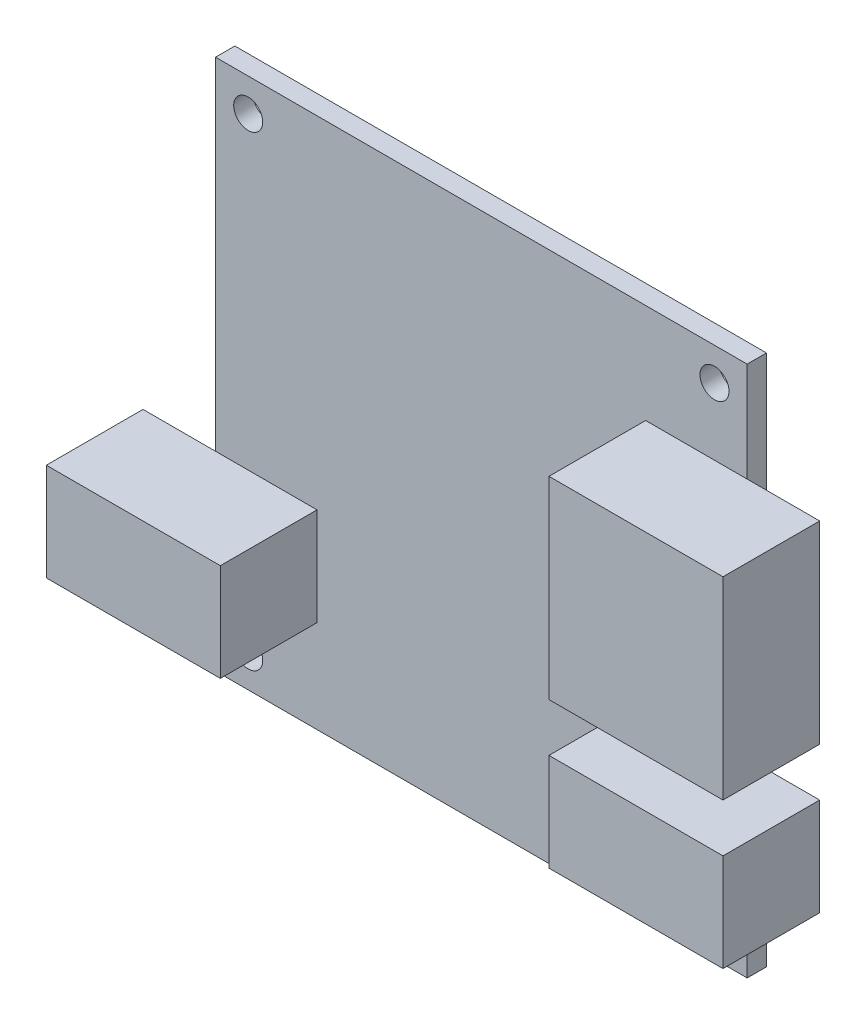
ISO-10303-21;
HEADER;
FILE_DESCRIPTION(('STEP AP214'),'2;1');
FILE_NAME('part.step','',(''),(''),'','','');
FILE_SCHEMA(('AUTOMOTIVE_DESIGN { 1 0 10303 214 1 1 1 1 }'));
ENDSEC;
DATA;
#1=APPLICATION_CONTEXT('core data for automotive mechanical design processes');
#2=APPLICATION_PROTOCOL_DEFINITION('international standard','automotive_design',2000,#1);
#3=PRODUCT_CONTEXT('',#1,'mechanical');
#4=PRODUCT('Part','Part','',(#3));
#5=PRODUCT_RELATED_PRODUCT_CATEGORY('part','',(#4));
#6=PRODUCT_DEFINITION_FORMATION('','',#4);
#7=PRODUCT_DEFINITION_CONTEXT('part definition',#1,'design');
#8=PRODUCT_DEFINITION('design','',#6,#7);
#9=PRODUCT_DEFINITION_SHAPE('','',#8);
#10=(LENGTH_UNIT() NAMED_UNIT(*) SI_UNIT(.MILLI.,.METRE.));
#11=(NAMED_UNIT(*) PLANE_ANGLE_UNIT() SI_UNIT($,.RADIAN.));
#12=(NAMED_UNIT(*) SI_UNIT($,.STERADIAN.) SOLID_ANGLE_UNIT());
#13=UNCERTAINTY_MEASURE_WITH_UNIT(LENGTH_MEASURE(1.E-05),#10,'distance_accuracy_value','');
#14=(GEOMETRIC_REPRESENTATION_CONTEXT(3) GLOBAL_UNCERTAINTY_ASSIGNED_CONTEXT((#13)) GLOBAL_UNIT_ASSIGNED_CONTEXT((#10,
#11,#12)) REPRESENTATION_CONTEXT('',''));
#15=CARTESIAN_POINT('',(0.,0.,0.));
#16=DIRECTION('',(0.,0.,1.));
#17=DIRECTION('',(1.,0.,0.));
#18=AXIS2_PLACEMENT_3D('',#15,#16,#17);
#19=CARTESIAN_POINT('',(0.,0.,2.));
#20=DIRECTION('',(0.,0.,-1.));
#21=DIRECTION('',(-1.,0.,0.));
#22=AXIS2_PLACEMENT_3D('',#19,#20,#21);
#23=PLANE('',#22);
#24=CARTESIAN_POINT('',(24.115,-24.115,2.));
#25=DIRECTION('',(0.,0.,-1.));
#26=DIRECTION('',(-1.,0.,0.));
#27=AXIS2_PLACEMENT_3D('',#24,#25,#26);
#28=CIRCLE('',#27,1.5);
#29=CARTESIAN_POINT('',(22.615,-24.115,2.));
#30=VERTEX_POINT('',#29);
#31=EDGE_CURVE('E274',#30,#30,#28,.T.);
#32=ORIENTED_EDGE('',*,*,#31,.T.);
#33=EDGE_LOOP('',(#32));
#34=FACE_BOUND('',#33,.T.);
#35=CARTESIAN_POINT('',(24.115,24.115,2.));
#36=DIRECTION('',(0.,0.,1.));
#37=DIRECTION('',(-1.,0.,0.));
#38=AXIS2_PLACEMENT_3D('',#35,#36,#37);
#39=CIRCLE('',#38,1.5);
#40=CARTESIAN_POINT('',(22.615,24.115,2.));
#41=VERTEX_POINT('',#40);
#42=EDGE_CURVE('E278',#41,#41,#39,.T.);
#43=ORIENTED_EDGE('',*,*,#42,.F.);
#44=EDGE_LOOP('',(#43));
#45=FACE_BOUND('',#44,.T.);
#46=CARTESIAN_POINT('',(-24.115,24.115,2.));
#47=DIRECTION('',(0.,0.,-1.));
#48=DIRECTION('',(1.,0.,0.));
#49=AXIS2_PLACEMENT_3D('',#46,#47,#48);
#50=CIRCLE('',#49,1.5);
#51=CARTESIAN_POINT('',(-22.615,24.115,2.));
#52=VERTEX_POINT('',#51);
#53=EDGE_CURVE('E284',#52,#52,#50,.T.);
#54=ORIENTED_EDGE('',*,*,#53,.T.);
#55=EDGE_LOOP('',(#54));
#56=FACE_BOUND('',#55,.T.);
#57=CARTESIAN_POINT('',(-24.115,-24.115,2.));
#58=DIRECTION('',(0.,0.,1.));
#59=DIRECTION('',(1.,0.,0.));
#60=AXIS2_PLACEMENT_3D('',#57,#58,#59);
#61=CIRCLE('',#60,1.5);
#62=CARTESIAN_POINT('',(-22.615,-24.115,2.));
#63=VERTEX_POINT('',#62);
#64=EDGE_CURVE('E290',#63,#63,#61,.T.);
#65=ORIENTED_EDGE('',*,*,#64,.F.);
#66=EDGE_LOOP('',(#65));
#67=FACE_BOUND('',#66,.T.);
#68=DIRECTION('',(0.,-1.,0.));
#69=VECTOR('',#68,1.);
#70=CARTESIAN_POINT('',(-27.495,-27.495,2.));
#71=LINE('',#70,#69);
#72=CARTESIAN_POINT('',(-27.495,27.495,2.));
#73=VERTEX_POINT('',#72);
#74=CARTESIAN_POINT('',(-27.495,-7.80499999999999,2.));
#75=VERTEX_POINT('',#74);
#76=EDGE_CURVE('E308',#73,#75,#71,.T.);
#77=ORIENTED_EDGE('',*,*,#76,.T.);
#78=DIRECTION('',(1.,0.,0.));
#79=VECTOR('',#78,1.);
#80=CARTESIAN_POINT('',(-16.995,-7.80499999999999,2.));
#81=LINE('',#80,#79);
#82=CARTESIAN_POINT('',(-16.995,-7.80499999999999,2.));
#83=VERTEX_POINT('',#82);
#84=EDGE_CURVE('E52',#75,#83,#81,.T.);
#85=ORIENTED_EDGE('',*,*,#84,.T.);
#86=DIRECTION('',(0.,-1.,0.));
#87=VECTOR('',#86,1.);
#88=CARTESIAN_POINT('',(-16.995,-7.80499999999999,2.));
#89=LINE('',#88,#87);
#90=CARTESIAN_POINT('',(-16.995,-17.905,2.));
#91=VERTEX_POINT('',#90);
#92=EDGE_CURVE('E57',#83,#91,#89,.T.);
#93=ORIENTED_EDGE('',*,*,#92,.T.);
#94=DIRECTION('',(-1.,0.,0.));
#95=VECTOR('',#94,1.);
#96=CARTESIAN_POINT('',(-16.995,-17.905,2.));
#97=LINE('',#96,#95);
#98=CARTESIAN_POINT('',(-27.495,-17.905,2.));
#99=VERTEX_POINT('',#98);
#100=EDGE_CURVE('E186',#91,#99,#97,.T.);
#101=ORIENTED_EDGE('',*,*,#100,.T.);
#102=CARTESIAN_POINT('',(-27.495,-27.495,2.));
#103=VERTEX_POINT('',#102);
#104=EDGE_CURVE('E307',#99,#103,#71,.T.);
#105=ORIENTED_EDGE('',*,*,#104,.T.);
#106=DIRECTION('',(1.,0.,0.));
#107=VECTOR('',#106,1.);
#108=CARTESIAN_POINT('',(-27.495,-27.495,2.));
#109=LINE('',#108,#107);
#110=CARTESIAN_POINT('',(27.495,-27.495,2.));
#111=VERTEX_POINT('',#110);
#112=EDGE_CURVE('E310',#103,#111,#109,.T.);
#113=ORIENTED_EDGE('',*,*,#112,.T.);
#114=DIRECTION('',(0.,1.,0.));
#115=VECTOR('',#114,1.);
#116=CARTESIAN_POINT('',(27.495,-27.495,2.));
#117=LINE('',#116,#115);
#118=CARTESIAN_POINT('',(27.495,-17.905,2.));
#119=VERTEX_POINT('',#118);
#120=EDGE_CURVE('E299',#111,#119,#117,.T.);
#121=ORIENTED_EDGE('',*,*,#120,.T.);
#122=DIRECTION('',(1.,0.,0.));
#123=VECTOR('',#122,1.);
#124=CARTESIAN_POINT('',(16.995,-17.905,2.));
#125=LINE('',#124,#123);
#126=CARTESIAN_POINT('',(16.995,-17.905,2.));
#127=VERTEX_POINT('',#126);
#128=EDGE_CURVE('E224',#127,#119,#125,.T.);
#129=ORIENTED_EDGE('',*,*,#128,.F.);
#130=DIRECTION('',(0.,-1.,0.));
#131=VECTOR('',#130,1.);
#132=CARTESIAN_POINT('',(16.995,-7.80499999999999,2.));
#133=LINE('',#132,#131);
#134=CARTESIAN_POINT('',(16.995,-7.80499999999999,2.));
#135=VERTEX_POINT('',#134);
#136=EDGE_CURVE('E175',#135,#127,#133,.T.);
#137=ORIENTED_EDGE('',*,*,#136,.F.);
#138=DIRECTION('',(-1.,0.,0.));
#139=VECTOR('',#138,1.);
#140=CARTESIAN_POINT('',(16.995,-7.80499999999999,2.));
#141=LINE('',#140,#139);
#142=CARTESIAN_POINT('',(27.495,-7.80499999999998,2.));
#143=VERTEX_POINT('',#142);
#144=EDGE_CURVE('E229',#143,#135,#141,.T.);
#145=ORIENTED_EDGE('',*,*,#144,.F.);
#146=CARTESIAN_POINT('',(27.495,-2.80499999999998,2.));
#147=VERTEX_POINT('',#146);
#148=EDGE_CURVE('E304',#143,#147,#117,.T.);
#149=ORIENTED_EDGE('',*,*,#148,.T.);
#150=DIRECTION('',(1.,0.,0.));
#151=VECTOR('',#150,1.);
#152=CARTESIAN_POINT('',(16.995,-2.80499999999998,2.));
#153=LINE('',#152,#151);
#154=CARTESIAN_POINT('',(16.995,-2.80499999999998,2.));
#155=VERTEX_POINT('',#154);
#156=EDGE_CURVE('E257',#155,#147,#153,.T.);
#157=ORIENTED_EDGE('',*,*,#156,.F.);
#158=DIRECTION('',(0.,-1.,0.));
#159=VECTOR('',#158,1.);
#160=CARTESIAN_POINT('',(16.995,17.195,2.));
#161=LINE('',#160,#159);
#162=CARTESIAN_POINT('',(16.995,17.195,2.));
#163=VERTEX_POINT('',#162);
#164=EDGE_CURVE('E243',#163,#155,#161,.T.);
#165=ORIENTED_EDGE('',*,*,#164,.F.);
#166=DIRECTION('',(-1.,0.,0.));
#167=VECTOR('',#166,1.);
#168=CARTESIAN_POINT('',(16.995,17.195,2.));
#169=LINE('',#168,#167);
#170=CARTESIAN_POINT('',(27.495,17.195,2.));
#171=VERTEX_POINT('',#170);
#172=EDGE_CURVE('E11',#171,#163,#169,.T.);
#173=ORIENTED_EDGE('',*,*,#172,.F.);
#174=CARTESIAN_POINT('',(27.495,27.495,2.));
#175=VERTEX_POINT('',#174);
#176=EDGE_CURVE('E322',#171,#175,#117,.T.);
#177=ORIENTED_EDGE('',*,*,#176,.T.);
#178=DIRECTION('',(-1.,0.,0.));
#179=VECTOR('',#178,1.);
#180=CARTESIAN_POINT('',(-27.495,27.495,2.));
#181=LINE('',#180,#179);
#182=EDGE_CURVE('E302',#175,#73,#181,.T.);
#183=ORIENTED_EDGE('',*,*,#182,.T.);
#184=EDGE_LOOP('',(#77,#85,#93,#101,#105,#113,#121,#129,#137,#145,#149,#157,#165,#173,#177,#183));
#185=FACE_BOUND('',#184,.T.);
#186=ADVANCED_FACE('F35',(#34,#45,#56,#67,#185),#23,.F.);
#187=CARTESIAN_POINT('',(27.495,-27.495,2.));
#188=DIRECTION('',(-1.,0.,0.));
#189=DIRECTION('',(0.,0.,1.));
#190=AXIS2_PLACEMENT_3D('',#187,#188,#189);
#191=PLANE('',#190);
#192=DIRECTION('',(0.,1.,0.));
#193=VECTOR('',#192,1.);
#194=CARTESIAN_POINT('',(27.495,-27.495,0.));
#195=LINE('',#194,#193);
#196=CARTESIAN_POINT('',(27.495,-27.495,0.));
#197=VERTEX_POINT('',#196);
#198=CARTESIAN_POINT('',(27.495,27.495,0.));
#199=VERTEX_POINT('',#198);
#200=EDGE_CURVE('E296',#197,#199,#195,.T.);
#201=ORIENTED_EDGE('',*,*,#200,.T.);
#202=DIRECTION('',(0.,0.,-1.));
#203=VECTOR('',#202,1.);
#204=CARTESIAN_POINT('',(27.495,27.495,2.));
#205=LINE('',#204,#203);
#206=EDGE_CURVE('E39',#175,#199,#205,.T.);
#207=ORIENTED_EDGE('',*,*,#206,.F.);
#208=ORIENTED_EDGE('',*,*,#176,.F.);
#209=EDGE_CURVE('E305',#147,#171,#117,.T.);
#210=ORIENTED_EDGE('',*,*,#209,.F.);
#211=ORIENTED_EDGE('',*,*,#148,.F.);
#212=EDGE_CURVE('E303',#119,#143,#117,.T.);
#213=ORIENTED_EDGE('',*,*,#212,.F.);
#214=ORIENTED_EDGE('',*,*,#120,.F.);
#215=DIRECTION('',(0.,0.,-1.));
#216=VECTOR('',#215,1.);
#217=CARTESIAN_POINT('',(27.495,-27.495,2.));
#218=LINE('',#217,#216);
#219=EDGE_CURVE('E313',#111,#197,#218,.T.);
#220=ORIENTED_EDGE('',*,*,#219,.T.);
#221=EDGE_LOOP('',(#201,#207,#208,#210,#211,#213,#214,#220));
#222=FACE_BOUND('',#221,.T.);
#223=ADVANCED_FACE('F37',(#222),#191,.F.);
#224=CARTESIAN_POINT('',(-27.495,27.495,2.));
#225=DIRECTION('',(0.,-1.,0.));
#226=DIRECTION('',(0.,0.,-1.));
#227=AXIS2_PLACEMENT_3D('',#224,#225,#226);
#228=PLANE('',#227);
#229=DIRECTION('',(-1.,0.,0.));
#230=VECTOR('',#229,1.);
#231=CARTESIAN_POINT('',(-27.495,27.495,0.));
#232=LINE('',#231,#230);
#233=CARTESIAN_POINT('',(-27.495,27.495,0.));
#234=VERTEX_POINT('',#233);
#235=EDGE_CURVE('E316',#199,#234,#232,.T.);
#236=ORIENTED_EDGE('',*,*,#235,.T.);
#237=DIRECTION('',(0.,0.,-1.));
#238=VECTOR('',#237,1.);
#239=CARTESIAN_POINT('',(-27.495,27.495,2.));
#240=LINE('',#239,#238);
#241=EDGE_CURVE('E327',#73,#234,#240,.T.);
#242=ORIENTED_EDGE('',*,*,#241,.F.);
#243=ORIENTED_EDGE('',*,*,#182,.F.);
#244=ORIENTED_EDGE('',*,*,#206,.T.);
#245=EDGE_LOOP('',(#236,#242,#243,#244));
#246=FACE_BOUND('',#245,.T.);
#247=ADVANCED_FACE('F337',(#246),#228,.F.);
#248=CARTESIAN_POINT('',(-27.495,-27.495,2.));
#249=DIRECTION('',(1.,0.,0.));
#250=DIRECTION('',(0.,0.,-1.));
#251=AXIS2_PLACEMENT_3D('',#248,#249,#250);
#252=PLANE('',#251);
#253=DIRECTION('',(0.,-1.,0.));
#254=VECTOR('',#253,1.);
#255=CARTESIAN_POINT('',(-27.495,-27.495,0.));
#256=LINE('',#255,#254);
#257=CARTESIAN_POINT('',(-27.495,-27.495,0.));
#258=VERTEX_POINT('',#257);
#259=EDGE_CURVE('E318',#234,#258,#256,.T.);
#260=ORIENTED_EDGE('',*,*,#259,.T.);
#261=DIRECTION('',(0.,0.,-1.));
#262=VECTOR('',#261,1.);
#263=CARTESIAN_POINT('',(-27.495,-27.495,2.));
#264=LINE('',#263,#262);
#265=EDGE_CURVE('E325',#103,#258,#264,.T.);
#266=ORIENTED_EDGE('',*,*,#265,.F.);
#267=ORIENTED_EDGE('',*,*,#104,.F.);
#268=EDGE_CURVE('E311',#75,#99,#71,.T.);
#269=ORIENTED_EDGE('',*,*,#268,.F.);
#270=ORIENTED_EDGE('',*,*,#76,.F.);
#271=ORIENTED_EDGE('',*,*,#241,.T.);
#272=EDGE_LOOP('',(#260,#266,#267,#269,#270,#271));
#273=FACE_BOUND('',#272,.T.);
#274=ADVANCED_FACE('F347',(#273),#252,.F.);
#275=CARTESIAN_POINT('',(-27.495,-27.495,2.));
#276=DIRECTION('',(0.,1.,0.));
#277=DIRECTION('',(0.,0.,1.));
#278=AXIS2_PLACEMENT_3D('',#275,#276,#277);
#279=PLANE('',#278);
#280=DIRECTION('',(1.,0.,0.));
#281=VECTOR('',#280,1.);
#282=CARTESIAN_POINT('',(-27.495,-27.495,0.));
#283=LINE('',#282,#281);
#284=EDGE_CURVE('E320',#258,#197,#283,.T.);
#285=ORIENTED_EDGE('',*,*,#284,.T.);
#286=ORIENTED_EDGE('',*,*,#219,.F.);
#287=ORIENTED_EDGE('',*,*,#112,.F.);
#288=ORIENTED_EDGE('',*,*,#265,.T.);
#289=EDGE_LOOP('',(#285,#286,#287,#288));
#290=FACE_BOUND('',#289,.T.);
#291=ADVANCED_FACE('F350',(#290),#279,.F.);
#292=CARTESIAN_POINT('',(0.,0.,0.));
#293=DIRECTION('',(0.,0.,-1.));
#294=DIRECTION('',(-1.,0.,0.));
#295=AXIS2_PLACEMENT_3D('',#292,#293,#294);
#296=PLANE('',#295);
#297=CARTESIAN_POINT('',(24.115,-24.115,0.));
#298=DIRECTION('',(0.,0.,-1.));
#299=DIRECTION('',(-1.,0.,0.));
#300=AXIS2_PLACEMENT_3D('',#297,#298,#299);
#301=CIRCLE('',#300,1.5);
#302=CARTESIAN_POINT('',(22.615,-24.115,0.));
#303=VERTEX_POINT('',#302);
#304=EDGE_CURVE('E275',#303,#303,#301,.T.);
#305=ORIENTED_EDGE('',*,*,#304,.F.);
#306=EDGE_LOOP('',(#305));
#307=FACE_BOUND('',#306,.T.);
#308=CARTESIAN_POINT('',(24.115,24.115,0.));
#309=DIRECTION('',(0.,0.,1.));
#310=DIRECTION('',(-1.,0.,0.));
#311=AXIS2_PLACEMENT_3D('',#308,#309,#310);
#312=CIRCLE('',#311,1.5);
#313=CARTESIAN_POINT('',(22.615,24.115,0.));
#314=VERTEX_POINT('',#313);
#315=EDGE_CURVE('E281',#314,#314,#312,.T.);
#316=ORIENTED_EDGE('',*,*,#315,.T.);
#317=EDGE_LOOP('',(#316));
#318=FACE_BOUND('',#317,.T.);
#319=CARTESIAN_POINT('',(-24.115,24.115,0.));
#320=DIRECTION('',(0.,0.,-1.));
#321=DIRECTION('',(1.,0.,0.));
#322=AXIS2_PLACEMENT_3D('',#319,#320,#321);
#323=CIRCLE('',#322,1.5);
#324=CARTESIAN_POINT('',(-22.615,24.115,0.));
#325=VERTEX_POINT('',#324);
#326=EDGE_CURVE('E287',#325,#325,#323,.T.);
#327=ORIENTED_EDGE('',*,*,#326,.F.);
#328=EDGE_LOOP('',(#327));
#329=FACE_BOUND('',#328,.T.);
#330=CARTESIAN_POINT('',(-24.115,-24.115,0.));
#331=DIRECTION('',(0.,0.,1.));
#332=DIRECTION('',(1.,0.,0.));
#333=AXIS2_PLACEMENT_3D('',#330,#331,#332);
#334=CIRCLE('',#333,1.5);
#335=CARTESIAN_POINT('',(-22.615,-24.115,0.));
#336=VERTEX_POINT('',#335);
#337=EDGE_CURVE('E293',#336,#336,#334,.T.);
#338=ORIENTED_EDGE('',*,*,#337,.T.);
#339=EDGE_LOOP('',(#338));
#340=FACE_BOUND('',#339,.T.);
#341=ORIENTED_EDGE('',*,*,#200,.F.);
#342=ORIENTED_EDGE('',*,*,#284,.F.);
#343=ORIENTED_EDGE('',*,*,#259,.F.);
#344=ORIENTED_EDGE('',*,*,#235,.F.);
#345=EDGE_LOOP('',(#341,#342,#343,#344));
#346=FACE_BOUND('',#345,.T.);
#347=ADVANCED_FACE('F345',(#307,#318,#329,#340,#346),#296,.T.);
#348=CARTESIAN_POINT('',(-24.115,-24.115,0.));
#349=DIRECTION('',(0.,0.,1.));
#350=DIRECTION('',(1.,0.,0.));
#351=AXIS2_PLACEMENT_3D('',#348,#349,#350);
#352=CYLINDRICAL_SURFACE('',#351,1.5);
#353=ORIENTED_EDGE('',*,*,#337,.F.);
#354=EDGE_LOOP('',(#353));
#355=FACE_BOUND('',#354,.T.);
#356=ORIENTED_EDGE('',*,*,#64,.T.);
#357=EDGE_LOOP('',(#356));
#358=FACE_BOUND('',#357,.T.);
#359=ADVANCED_FACE('F379',(#355,#358),#352,.F.);
#360=CARTESIAN_POINT('',(-24.115,24.115,0.));
#361=DIRECTION('',(0.,0.,1.));
#362=DIRECTION('',(1.,0.,0.));
#363=AXIS2_PLACEMENT_3D('',#360,#361,#362);
#364=CYLINDRICAL_SURFACE('',#363,1.5);
#365=ORIENTED_EDGE('',*,*,#326,.T.);
#366=EDGE_LOOP('',(#365));
#367=FACE_BOUND('',#366,.T.);
#368=ORIENTED_EDGE('',*,*,#53,.F.);
#369=EDGE_LOOP('',(#368));
#370=FACE_BOUND('',#369,.T.);
#371=ADVANCED_FACE('F413',(#367,#370),#364,.F.);
#372=CARTESIAN_POINT('',(24.115,24.115,0.));
#373=DIRECTION('',(0.,0.,1.));
#374=DIRECTION('',(1.,0.,0.));
#375=AXIS2_PLACEMENT_3D('',#372,#373,#374);
#376=CYLINDRICAL_SURFACE('',#375,1.5);
#377=ORIENTED_EDGE('',*,*,#315,.F.);
#378=EDGE_LOOP('',(#377));
#379=FACE_BOUND('',#378,.T.);
#380=ORIENTED_EDGE('',*,*,#42,.T.);
#381=EDGE_LOOP('',(#380));
#382=FACE_BOUND('',#381,.T.);
#383=ADVANCED_FACE('F419',(#379,#382),#376,.F.);
#384=CARTESIAN_POINT('',(24.115,-24.115,0.));
#385=DIRECTION('',(0.,0.,1.));
#386=DIRECTION('',(1.,0.,0.));
#387=AXIS2_PLACEMENT_3D('',#384,#385,#386);
#388=CYLINDRICAL_SURFACE('',#387,1.5);
#389=ORIENTED_EDGE('',*,*,#304,.T.);
#390=EDGE_LOOP('',(#389));
#391=FACE_BOUND('',#390,.T.);
#392=ORIENTED_EDGE('',*,*,#31,.F.);
#393=EDGE_LOOP('',(#392));
#394=FACE_BOUND('',#393,.T.);
#395=ADVANCED_FACE('F425',(#391,#394),#388,.F.);
#396=CARTESIAN_POINT('',(0.,0.,2.));
#397=DIRECTION('',(0.,0.,1.));
#398=DIRECTION('',(1.,0.,0.));
#399=AXIS2_PLACEMENT_3D('',#396,#397,#398);
#400=PLANE('',#399);
#401=CARTESIAN_POINT('',(34.995,-2.80499999999998,2.));
#402=VERTEX_POINT('',#401);
#403=EDGE_CURVE('E256',#147,#402,#153,.T.);
#404=ORIENTED_EDGE('',*,*,#403,.F.);
#405=ORIENTED_EDGE('',*,*,#209,.T.);
#406=CARTESIAN_POINT('',(34.995,17.195,2.));
#407=VERTEX_POINT('',#406);
#408=EDGE_CURVE('E45',#407,#171,#169,.T.);
#409=ORIENTED_EDGE('',*,*,#408,.F.);
#410=DIRECTION('',(0.,1.,0.));
#411=VECTOR('',#410,1.);
#412=CARTESIAN_POINT('',(34.995,17.195,2.));
#413=LINE('',#412,#411);
#414=EDGE_CURVE('E260',#402,#407,#413,.T.);
#415=ORIENTED_EDGE('',*,*,#414,.F.);
#416=EDGE_LOOP('',(#404,#405,#409,#415));
#417=FACE_BOUND('',#416,.T.);
#418=ADVANCED_FACE('F433',(#417),#400,.F.);
#419=CARTESIAN_POINT('',(16.995,17.195,12.));
#420=DIRECTION('',(1.,0.,0.));
#421=DIRECTION('',(0.,1.,0.));
#422=AXIS2_PLACEMENT_3D('',#419,#420,#421);
#423=PLANE('',#422);
#424=ORIENTED_EDGE('',*,*,#164,.T.);
#425=DIRECTION('',(0.,0.,-1.));
#426=VECTOR('',#425,1.);
#427=CARTESIAN_POINT('',(16.995,-2.80499999999998,12.));
#428=LINE('',#427,#426);
#429=CARTESIAN_POINT('',(16.995,-2.80499999999998,12.));
#430=VERTEX_POINT('',#429);
#431=EDGE_CURVE('E271',#430,#155,#428,.T.);
#432=ORIENTED_EDGE('',*,*,#431,.F.);
#433=DIRECTION('',(0.,-1.,0.));
#434=VECTOR('',#433,1.);
#435=CARTESIAN_POINT('',(16.995,17.195,12.));
#436=LINE('',#435,#434);
#437=CARTESIAN_POINT('',(16.995,17.195,12.));
#438=VERTEX_POINT('',#437);
#439=EDGE_CURVE('E244',#438,#430,#436,.T.);
#440=ORIENTED_EDGE('',*,*,#439,.F.);
#441=DIRECTION('',(0.,0.,-1.));
#442=VECTOR('',#441,1.);
#443=CARTESIAN_POINT('',(16.995,17.195,12.));
#444=LINE('',#443,#442);
#445=EDGE_CURVE('E253',#438,#163,#444,.T.);
#446=ORIENTED_EDGE('',*,*,#445,.T.);
#447=EDGE_LOOP('',(#424,#432,#440,#446));
#448=FACE_BOUND('',#447,.T.);
#449=ADVANCED_FACE('F441',(#448),#423,.F.);
#450=CARTESIAN_POINT('',(16.995,-2.80499999999998,12.));
#451=DIRECTION('',(0.,1.,0.));
#452=DIRECTION('',(0.,0.,1.));
#453=AXIS2_PLACEMENT_3D('',#450,#451,#452);
#454=PLANE('',#453);
#455=ORIENTED_EDGE('',*,*,#156,.T.);
#456=ORIENTED_EDGE('',*,*,#403,.T.);
#457=DIRECTION('',(0.,0.,-1.));
#458=VECTOR('',#457,1.);
#459=CARTESIAN_POINT('',(34.995,-2.80499999999998,12.));
#460=LINE('',#459,#458);
#461=CARTESIAN_POINT('',(34.995,-2.80499999999998,12.));
#462=VERTEX_POINT('',#461);
#463=EDGE_CURVE('E268',#462,#402,#460,.T.);
#464=ORIENTED_EDGE('',*,*,#463,.F.);
#465=DIRECTION('',(1.,0.,0.));
#466=VECTOR('',#465,1.);
#467=CARTESIAN_POINT('',(16.995,-2.80499999999998,12.));
#468=LINE('',#467,#466);
#469=EDGE_CURVE('E247',#430,#462,#468,.T.);
#470=ORIENTED_EDGE('',*,*,#469,.F.);
#471=ORIENTED_EDGE('',*,*,#431,.T.);
#472=EDGE_LOOP('',(#455,#456,#464,#470,#471));
#473=FACE_BOUND('',#472,.T.);
#474=ADVANCED_FACE('F449',(#473),#454,.F.);
#475=CARTESIAN_POINT('',(34.995,17.195,12.));
#476=DIRECTION('',(-1.,0.,0.));
#477=DIRECTION('',(0.,0.,1.));
#478=AXIS2_PLACEMENT_3D('',#475,#476,#477);
#479=PLANE('',#478);
#480=ORIENTED_EDGE('',*,*,#414,.T.);
#481=DIRECTION('',(0.,0.,-1.));
#482=VECTOR('',#481,1.);
#483=CARTESIAN_POINT('',(34.995,17.195,12.));
#484=LINE('',#483,#482);
#485=CARTESIAN_POINT('',(34.995,17.195,12.));
#486=VERTEX_POINT('',#485);
#487=EDGE_CURVE('E265',#486,#407,#484,.T.);
#488=ORIENTED_EDGE('',*,*,#487,.F.);
#489=DIRECTION('',(0.,1.,0.));
#490=VECTOR('',#489,1.);
#491=CARTESIAN_POINT('',(34.995,17.195,12.));
#492=LINE('',#491,#490);
#493=EDGE_CURVE('E249',#462,#486,#492,.T.);
#494=ORIENTED_EDGE('',*,*,#493,.F.);
#495=ORIENTED_EDGE('',*,*,#463,.T.);
#496=EDGE_LOOP('',(#480,#488,#494,#495));
#497=FACE_BOUND('',#496,.T.);
#498=ADVANCED_FACE('F457',(#497),#479,.F.);
#499=CARTESIAN_POINT('',(16.995,17.195,12.));
#500=DIRECTION('',(0.,-1.,0.));
#501=DIRECTION('',(0.,0.,-1.));
#502=AXIS2_PLACEMENT_3D('',#499,#500,#501);
#503=PLANE('',#502);
#504=ORIENTED_EDGE('',*,*,#408,.T.);
#505=ORIENTED_EDGE('',*,*,#172,.T.);
#506=ORIENTED_EDGE('',*,*,#445,.F.);
#507=DIRECTION('',(-1.,0.,0.));
#508=VECTOR('',#507,1.);
#509=CARTESIAN_POINT('',(16.995,17.195,12.));
#510=LINE('',#509,#508);
#511=EDGE_CURVE('E251',#486,#438,#510,.T.);
#512=ORIENTED_EDGE('',*,*,#511,.F.);
#513=ORIENTED_EDGE('',*,*,#487,.T.);
#514=EDGE_LOOP('',(#504,#505,#506,#512,#513));
#515=FACE_BOUND('',#514,.T.);
#516=ADVANCED_FACE('F465',(#515),#503,.F.);
#517=CARTESIAN_POINT('',(0.,0.,12.));
#518=DIRECTION('',(0.,0.,1.));
#519=DIRECTION('',(1.,0.,0.));
#520=AXIS2_PLACEMENT_3D('',#517,#518,#519);
#521=PLANE('',#520);
#522=ORIENTED_EDGE('',*,*,#439,.T.);
#523=ORIENTED_EDGE('',*,*,#469,.T.);
#524=ORIENTED_EDGE('',*,*,#493,.T.);
#525=ORIENTED_EDGE('',*,*,#511,.T.);
#526=EDGE_LOOP('',(#522,#523,#524,#525));
#527=FACE_BOUND('',#526,.T.);
#528=ADVANCED_FACE('F473',(#527),#521,.T.);
#529=CARTESIAN_POINT('',(0.,0.,2.));
#530=DIRECTION('',(0.,0.,1.));
#531=DIRECTION('',(1.,0.,0.));
#532=AXIS2_PLACEMENT_3D('',#529,#530,#531);
#533=PLANE('',#532);
#534=CARTESIAN_POINT('',(34.995,-17.905,2.));
#535=VERTEX_POINT('',#534);
#536=EDGE_CURVE('E223',#119,#535,#125,.T.);
#537=ORIENTED_EDGE('',*,*,#536,.F.);
#538=ORIENTED_EDGE('',*,*,#212,.T.);
#539=CARTESIAN_POINT('',(34.995,-7.80499999999998,2.));
#540=VERTEX_POINT('',#539);
#541=EDGE_CURVE('E214',#540,#143,#141,.T.);
#542=ORIENTED_EDGE('',*,*,#541,.F.);
#543=DIRECTION('',(0.,1.,0.));
#544=VECTOR('',#543,1.);
#545=CARTESIAN_POINT('',(34.995,-7.80499999999998,2.));
#546=LINE('',#545,#544);
#547=EDGE_CURVE('E227',#535,#540,#546,.T.);
#548=ORIENTED_EDGE('',*,*,#547,.F.);
#549=EDGE_LOOP('',(#537,#538,#542,#548));
#550=FACE_BOUND('',#549,.T.);
#551=ADVANCED_FACE('F481',(#550),#533,.F.);
#552=CARTESIAN_POINT('',(16.995,-7.80499999999999,12.));
#553=DIRECTION('',(1.,0.,0.));
#554=DIRECTION('',(0.,0.,-1.));
#555=AXIS2_PLACEMENT_3D('',#552,#553,#554);
#556=PLANE('',#555);
#557=ORIENTED_EDGE('',*,*,#136,.T.);
#558=DIRECTION('',(0.,0.,-1.));
#559=VECTOR('',#558,1.);
#560=CARTESIAN_POINT('',(16.995,-17.905,12.));
#561=LINE('',#560,#559);
#562=CARTESIAN_POINT('',(16.995,-17.905,12.));
#563=VERTEX_POINT('',#562);
#564=EDGE_CURVE('E240',#563,#127,#561,.T.);
#565=ORIENTED_EDGE('',*,*,#564,.F.);
#566=DIRECTION('',(0.,-1.,0.));
#567=VECTOR('',#566,1.);
#568=CARTESIAN_POINT('',(16.995,-7.80499999999999,12.));
#569=LINE('',#568,#567);
#570=CARTESIAN_POINT('',(16.995,-7.80499999999999,12.));
#571=VERTEX_POINT('',#570);
#572=EDGE_CURVE('E210',#571,#563,#569,.T.);
#573=ORIENTED_EDGE('',*,*,#572,.F.);
#574=DIRECTION('',(0.,0.,-1.));
#575=VECTOR('',#574,1.);
#576=CARTESIAN_POINT('',(16.995,-7.80499999999999,12.));
#577=LINE('',#576,#575);
#578=EDGE_CURVE('E220',#571,#135,#577,.T.);
#579=ORIENTED_EDGE('',*,*,#578,.T.);
#580=EDGE_LOOP('',(#557,#565,#573,#579));
#581=FACE_BOUND('',#580,.T.);
#582=ADVANCED_FACE('F489',(#581),#556,.F.);
#583=CARTESIAN_POINT('',(16.995,-17.905,12.));
#584=DIRECTION('',(0.,1.,0.));
#585=DIRECTION('',(0.,0.,1.));
#586=AXIS2_PLACEMENT_3D('',#583,#584,#585);
#587=PLANE('',#586);
#588=ORIENTED_EDGE('',*,*,#128,.T.);
#589=ORIENTED_EDGE('',*,*,#536,.T.);
#590=DIRECTION('',(0.,0.,-1.));
#591=VECTOR('',#590,1.);
#592=CARTESIAN_POINT('',(34.995,-17.905,12.));
#593=LINE('',#592,#591);
#594=CARTESIAN_POINT('',(34.995,-17.905,12.));
#595=VERTEX_POINT('',#594);
#596=EDGE_CURVE('E237',#595,#535,#593,.T.);
#597=ORIENTED_EDGE('',*,*,#596,.F.);
#598=DIRECTION('',(1.,0.,0.));
#599=VECTOR('',#598,1.);
#600=CARTESIAN_POINT('',(16.995,-17.905,12.));
#601=LINE('',#600,#599);
#602=EDGE_CURVE('E213',#563,#595,#601,.T.);
#603=ORIENTED_EDGE('',*,*,#602,.F.);
#604=ORIENTED_EDGE('',*,*,#564,.T.);
#605=EDGE_LOOP('',(#588,#589,#597,#603,#604));
#606=FACE_BOUND('',#605,.T.);
#607=ADVANCED_FACE('F497',(#606),#587,.F.);
#608=CARTESIAN_POINT('',(34.995,-7.80499999999998,12.));
#609=DIRECTION('',(-1.,0.,0.));
#610=DIRECTION('',(0.,-1.,0.));
#611=AXIS2_PLACEMENT_3D('',#608,#609,#610);
#612=PLANE('',#611);
#613=ORIENTED_EDGE('',*,*,#547,.T.);
#614=DIRECTION('',(0.,0.,-1.));
#615=VECTOR('',#614,1.);
#616=CARTESIAN_POINT('',(34.995,-7.80499999999998,12.));
#617=LINE('',#616,#615);
#618=CARTESIAN_POINT('',(34.995,-7.80499999999998,12.));
#619=VERTEX_POINT('',#618);
#620=EDGE_CURVE('E234',#619,#540,#617,.T.);
#621=ORIENTED_EDGE('',*,*,#620,.F.);
#622=DIRECTION('',(0.,1.,0.));
#623=VECTOR('',#622,1.);
#624=CARTESIAN_POINT('',(34.995,-7.80499999999998,12.));
#625=LINE('',#624,#623);
#626=EDGE_CURVE('E216',#595,#619,#625,.T.);
#627=ORIENTED_EDGE('',*,*,#626,.F.);
#628=ORIENTED_EDGE('',*,*,#596,.T.);
#629=EDGE_LOOP('',(#613,#621,#627,#628));
#630=FACE_BOUND('',#629,.T.);
#631=ADVANCED_FACE('F505',(#630),#612,.F.);
#632=CARTESIAN_POINT('',(16.995,-7.80499999999999,12.));
#633=DIRECTION('',(0.,-1.,0.));
#634=DIRECTION('',(1.,0.,0.));
#635=AXIS2_PLACEMENT_3D('',#632,#633,#634);
#636=PLANE('',#635);
#637=ORIENTED_EDGE('',*,*,#541,.T.);
#638=ORIENTED_EDGE('',*,*,#144,.T.);
#639=ORIENTED_EDGE('',*,*,#578,.F.);
#640=DIRECTION('',(-1.,0.,0.));
#641=VECTOR('',#640,1.);
#642=CARTESIAN_POINT('',(16.995,-7.80499999999999,12.));
#643=LINE('',#642,#641);
#644=EDGE_CURVE('E218',#619,#571,#643,.T.);
#645=ORIENTED_EDGE('',*,*,#644,.F.);
#646=ORIENTED_EDGE('',*,*,#620,.T.);
#647=EDGE_LOOP('',(#637,#638,#639,#645,#646));
#648=FACE_BOUND('',#647,.T.);
#649=ADVANCED_FACE('F513',(#648),#636,.F.);
#650=CARTESIAN_POINT('',(0.,0.,12.));
#651=DIRECTION('',(0.,0.,1.));
#652=DIRECTION('',(1.,0.,0.));
#653=AXIS2_PLACEMENT_3D('',#650,#651,#652);
#654=PLANE('',#653);
#655=ORIENTED_EDGE('',*,*,#572,.T.);
#656=ORIENTED_EDGE('',*,*,#602,.T.);
#657=ORIENTED_EDGE('',*,*,#626,.T.);
#658=ORIENTED_EDGE('',*,*,#644,.T.);
#659=EDGE_LOOP('',(#655,#656,#657,#658));
#660=FACE_BOUND('',#659,.T.);
#661=ADVANCED_FACE('F521',(#660),#654,.T.);
#662=CARTESIAN_POINT('',(0.,0.,2.));
#663=DIRECTION('',(0.,0.,1.));
#664=DIRECTION('',(-1.,0.,0.));
#665=AXIS2_PLACEMENT_3D('',#662,#663,#664);
#666=PLANE('',#665);
#667=CARTESIAN_POINT('',(-34.995,-7.80499999999998,2.));
#668=VERTEX_POINT('',#667);
#669=EDGE_CURVE('E197',#668,#75,#81,.T.);
#670=ORIENTED_EDGE('',*,*,#669,.T.);
#671=ORIENTED_EDGE('',*,*,#268,.T.);
#672=CARTESIAN_POINT('',(-34.995,-17.905,2.));
#673=VERTEX_POINT('',#672);
#674=EDGE_CURVE('E203',#99,#673,#97,.T.);
#675=ORIENTED_EDGE('',*,*,#674,.T.);
#676=DIRECTION('',(0.,1.,0.));
#677=VECTOR('',#676,1.);
#678=CARTESIAN_POINT('',(-34.995,-7.80499999999998,2.));
#679=LINE('',#678,#677);
#680=EDGE_CURVE('E200',#673,#668,#679,.T.);
#681=ORIENTED_EDGE('',*,*,#680,.T.);
#682=EDGE_LOOP('',(#670,#671,#675,#681));
#683=FACE_BOUND('',#682,.T.);
#684=ADVANCED_FACE('F356',(#683),#666,.F.);
#685=CARTESIAN_POINT('',(-16.995,-7.80499999999999,12.));
#686=DIRECTION('',(1.,0.,0.));
#687=DIRECTION('',(0.,0.,-1.));
#688=AXIS2_PLACEMENT_3D('',#685,#686,#687);
#689=PLANE('',#688);
#690=ORIENTED_EDGE('',*,*,#92,.F.);
#691=DIRECTION('',(0.,0.,-1.));
#692=VECTOR('',#691,1.);
#693=CARTESIAN_POINT('',(-16.995,-7.80499999999999,12.));
#694=LINE('',#693,#692);
#695=CARTESIAN_POINT('',(-16.995,-7.80499999999999,12.));
#696=VERTEX_POINT('',#695);
#697=EDGE_CURVE('E168',#696,#83,#694,.T.);
#698=ORIENTED_EDGE('',*,*,#697,.F.);
#699=DIRECTION('',(0.,-1.,0.));
#700=VECTOR('',#699,1.);
#701=CARTESIAN_POINT('',(-16.995,-7.80499999999999,12.));
#702=LINE('',#701,#700);
#703=CARTESIAN_POINT('',(-16.995,-17.905,12.));
#704=VERTEX_POINT('',#703);
#705=EDGE_CURVE('E171',#696,#704,#702,.T.);
#706=ORIENTED_EDGE('',*,*,#705,.T.);
#707=DIRECTION('',(0.,0.,-1.));
#708=VECTOR('',#707,1.);
#709=CARTESIAN_POINT('',(-16.995,-17.905,12.));
#710=LINE('',#709,#708);
#711=EDGE_CURVE('E195',#704,#91,#710,.T.);
#712=ORIENTED_EDGE('',*,*,#711,.T.);
#713=EDGE_LOOP('',(#690,#698,#706,#712));
#714=FACE_BOUND('',#713,.T.);
#715=ADVANCED_FACE('F170',(#714),#689,.T.);
#716=CARTESIAN_POINT('',(-16.995,-7.80499999999999,12.));
#717=DIRECTION('',(0.,1.,0.));
#718=DIRECTION('',(-1.,0.,0.));
#719=AXIS2_PLACEMENT_3D('',#716,#717,#718);
#720=PLANE('',#719);
#721=ORIENTED_EDGE('',*,*,#669,.F.);
#722=DIRECTION('',(0.,0.,-1.));
#723=VECTOR('',#722,1.);
#724=CARTESIAN_POINT('',(-34.995,-7.80499999999998,12.));
#725=LINE('',#724,#723);
#726=CARTESIAN_POINT('',(-34.995,-7.80499999999998,12.));
#727=VERTEX_POINT('',#726);
#728=EDGE_CURVE('E176',#727,#668,#725,.T.);
#729=ORIENTED_EDGE('',*,*,#728,.F.);
#730=DIRECTION('',(1.,0.,0.));
#731=VECTOR('',#730,1.);
#732=CARTESIAN_POINT('',(-16.995,-7.80499999999999,12.));
#733=LINE('',#732,#731);
#734=EDGE_CURVE('E182',#727,#696,#733,.T.);
#735=ORIENTED_EDGE('',*,*,#734,.T.);
#736=ORIENTED_EDGE('',*,*,#697,.T.);
#737=ORIENTED_EDGE('',*,*,#84,.F.);
#738=EDGE_LOOP('',(#721,#729,#735,#736,#737));
#739=FACE_BOUND('',#738,.T.);
#740=ADVANCED_FACE('F189',(#739),#720,.T.);
#741=CARTESIAN_POINT('',(-34.995,-7.80499999999998,12.));
#742=DIRECTION('',(-1.,0.,0.));
#743=DIRECTION('',(0.,-1.,0.));
#744=AXIS2_PLACEMENT_3D('',#741,#742,#743);
#745=PLANE('',#744);
#746=ORIENTED_EDGE('',*,*,#680,.F.);
#747=DIRECTION('',(0.,0.,-1.));
#748=VECTOR('',#747,1.);
#749=CARTESIAN_POINT('',(-34.995,-17.905,12.));
#750=LINE('',#749,#748);
#751=CARTESIAN_POINT('',(-34.995,-17.905,12.));
#752=VERTEX_POINT('',#751);
#753=EDGE_CURVE('E206',#752,#673,#750,.T.);
#754=ORIENTED_EDGE('',*,*,#753,.F.);
#755=DIRECTION('',(0.,1.,0.));
#756=VECTOR('',#755,1.);
#757=CARTESIAN_POINT('',(-34.995,-7.80499999999998,12.));
#758=LINE('',#757,#756);
#759=EDGE_CURVE('E190',#752,#727,#758,.T.);
#760=ORIENTED_EDGE('',*,*,#759,.T.);
#761=ORIENTED_EDGE('',*,*,#728,.T.);
#762=EDGE_LOOP('',(#746,#754,#760,#761));
#763=FACE_BOUND('',#762,.T.);
#764=ADVANCED_FACE('F361',(#763),#745,.T.);
#765=CARTESIAN_POINT('',(-16.995,-17.905,12.));
#766=DIRECTION('',(0.,-1.,0.));
#767=DIRECTION('',(0.,0.,-1.));
#768=AXIS2_PLACEMENT_3D('',#765,#766,#767);
#769=PLANE('',#768);
#770=ORIENTED_EDGE('',*,*,#100,.F.);
#771=ORIENTED_EDGE('',*,*,#711,.F.);
#772=DIRECTION('',(-1.,0.,0.));
#773=VECTOR('',#772,1.);
#774=CARTESIAN_POINT('',(-16.995,-17.905,12.));
#775=LINE('',#774,#773);
#776=EDGE_CURVE('E185',#704,#752,#775,.T.);
#777=ORIENTED_EDGE('',*,*,#776,.T.);
#778=ORIENTED_EDGE('',*,*,#753,.T.);
#779=ORIENTED_EDGE('',*,*,#674,.F.);
#780=EDGE_LOOP('',(#770,#771,#777,#778,#779));
#781=FACE_BOUND('',#780,.T.);
#782=ADVANCED_FACE('F358',(#781),#769,.T.);
#783=CARTESIAN_POINT('',(0.,0.,12.));
#784=DIRECTION('',(0.,0.,1.));
#785=DIRECTION('',(-1.,0.,0.));
#786=AXIS2_PLACEMENT_3D('',#783,#784,#785);
#787=PLANE('',#786);
#788=ORIENTED_EDGE('',*,*,#705,.F.);
#789=ORIENTED_EDGE('',*,*,#734,.F.);
#790=ORIENTED_EDGE('',*,*,#759,.F.);
#791=ORIENTED_EDGE('',*,*,#776,.F.);
#792=EDGE_LOOP('',(#788,#789,#790,#791));
#793=FACE_BOUND('',#792,.T.);
#794=ADVANCED_FACE('F180',(#793),#787,.T.);
#795=CLOSED_SHELL('',(#186,#223,#247,#274,#291,#347,#359,#371,#383,#395,#418,#449,#474,#498,
#516,#528,#551,#582,#607,#631,#649,#661,#684,#715,#740,#764,#782,#794));
#796=MANIFOLD_SOLID_BREP('B2',#795);
#797=ADVANCED_BREP_SHAPE_REPRESENTATION('',(#18,#796),#14);
#798=SHAPE_DEFINITION_REPRESENTATION(#9,#797);
ENDSEC;
END-ISO-10303-21;
